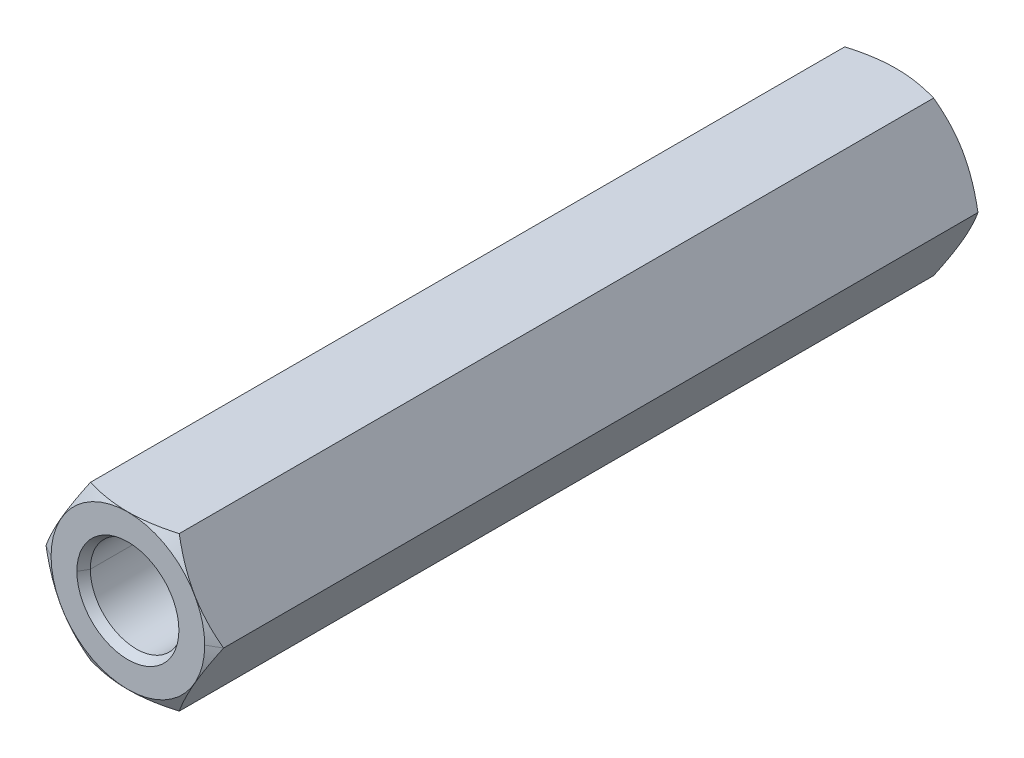
ISO-10303-21;
HEADER;
FILE_DESCRIPTION(('STEP AP214'),'2;1');
FILE_NAME('part.step','',(''),(''),'','','');
FILE_SCHEMA(('AUTOMOTIVE_DESIGN { 1 0 10303 214 1 1 1 1 }'));
ENDSEC;
DATA;
#1=APPLICATION_CONTEXT('core data for automotive mechanical design processes');
#2=APPLICATION_PROTOCOL_DEFINITION('international standard','automotive_design',2000,#1);
#3=PRODUCT_CONTEXT('',#1,'mechanical');
#4=PRODUCT('Part','Part','',(#3));
#5=PRODUCT_RELATED_PRODUCT_CATEGORY('part','',(#4));
#6=PRODUCT_DEFINITION_FORMATION('','',#4);
#7=PRODUCT_DEFINITION_CONTEXT('part definition',#1,'design');
#8=PRODUCT_DEFINITION('design','',#6,#7);
#9=PRODUCT_DEFINITION_SHAPE('','',#8);
#10=(LENGTH_UNIT() NAMED_UNIT(*) SI_UNIT(.MILLI.,.METRE.));
#11=(NAMED_UNIT(*) PLANE_ANGLE_UNIT() SI_UNIT($,.RADIAN.));
#12=(NAMED_UNIT(*) SI_UNIT($,.STERADIAN.) SOLID_ANGLE_UNIT());
#13=UNCERTAINTY_MEASURE_WITH_UNIT(LENGTH_MEASURE(1.E-05),#10,'distance_accuracy_value','');
#14=(GEOMETRIC_REPRESENTATION_CONTEXT(3) GLOBAL_UNCERTAINTY_ASSIGNED_CONTEXT((#13)) GLOBAL_UNIT_ASSIGNED_CONTEXT((#10,
#11,#12)) REPRESENTATION_CONTEXT('',''));
#15=CARTESIAN_POINT('',(0.,0.,0.));
#16=DIRECTION('',(0.,0.,1.));
#17=DIRECTION('',(1.,0.,0.));
#18=AXIS2_PLACEMENT_3D('',#15,#16,#17);
#19=CARTESIAN_POINT('',(116.318744279938,82.5620432923505,90.4476083123826));
#20=DIRECTION('',(0.,0.,-1.));
#21=DIRECTION('',(1.,0.,0.));
#22=AXIS2_PLACEMENT_3D('',#19,#20,#21);
#23=CONICAL_SURFACE('',#22,1.73205080757048,1.047197551197);
#24=DIRECTION('',(0.86602540378464,0.,-0.499999999999652));
#25=VECTOR('',#24,1.);
#26=CARTESIAN_POINT('',(118.050795087508,82.5620432923505,90.4476083123826));
#27=LINE('',#26,#25);
#28=CARTESIAN_POINT('',(116.318744279938,82.5620432923505,91.4476083123826));
#29=VERTEX_POINT('',#28);
#30=CARTESIAN_POINT('',(117.818744279938,82.5620432923505,90.5815829085986));
#31=VERTEX_POINT('',#30);
#32=EDGE_CURVE('E67',#29,#31,#27,.T.);
#33=ORIENTED_EDGE('',*,*,#32,.F.);
#34=DIRECTION('',(-0.86602540378464,0.,-0.499999999999652));
#35=VECTOR('',#34,1.);
#36=CARTESIAN_POINT('',(114.586693472367,82.5620432923505,90.4476083123826));
#37=LINE('',#36,#35);
#38=CARTESIAN_POINT('',(114.818744279938,82.5620432923505,90.5815829085986));
#39=VERTEX_POINT('',#38);
#40=EDGE_CURVE('E11',#29,#39,#37,.T.);
#41=ORIENTED_EDGE('',*,*,#40,.T.);
#42=CARTESIAN_POINT('',(116.318744279938,82.5620432923505,90.5815829085986));
#43=DIRECTION('',(0.,0.,1.));
#44=DIRECTION('',(1.,0.,0.));
#45=AXIS2_PLACEMENT_3D('',#42,#43,#44);
#46=CIRCLE('',#45,1.5);
#47=EDGE_CURVE('E55',#31,#39,#46,.T.);
#48=ORIENTED_EDGE('',*,*,#47,.F.);
#49=EDGE_LOOP('',(#33,#41,#48));
#50=FACE_BOUND('',#49,.T.);
#51=ADVANCED_FACE('F44',(#50),#23,.F.);
#52=CARTESIAN_POINT('',(116.318744279938,82.5620432923505,90.5815829085986));
#53=DIRECTION('',(0.,0.,-1.));
#54=DIRECTION('',(1.,0.,0.));
#55=AXIS2_PLACEMENT_3D('',#52,#53,#54);
#56=CYLINDRICAL_SURFACE('',#55,1.5);
#57=ORIENTED_EDGE('',*,*,#47,.T.);
#58=DIRECTION('',(0.,0.,-1.));
#59=VECTOR('',#58,1.);
#60=CARTESIAN_POINT('',(114.818744279938,82.5620432923505,90.5815829085986));
#61=LINE('',#60,#59);
#62=CARTESIAN_POINT('',(114.818744279938,82.5620432923505,80.8587110378087));
#63=VERTEX_POINT('',#62);
#64=EDGE_CURVE('E313',#39,#63,#61,.T.);
#65=ORIENTED_EDGE('',*,*,#64,.T.);
#66=CARTESIAN_POINT('',(116.318744279938,82.5620432923505,80.8587110378087));
#67=DIRECTION('',(0.,0.,1.));
#68=DIRECTION('',(1.,0.,0.));
#69=AXIS2_PLACEMENT_3D('',#66,#67,#68);
#70=CIRCLE('',#69,1.5);
#71=CARTESIAN_POINT('',(117.818744279938,82.5620432923505,80.8587110378087));
#72=VERTEX_POINT('',#71);
#73=EDGE_CURVE('E305',#72,#63,#70,.T.);
#74=ORIENTED_EDGE('',*,*,#73,.F.);
#75=DIRECTION('',(0.,0.,-1.));
#76=VECTOR('',#75,1.);
#77=CARTESIAN_POINT('',(117.818744279938,82.5620432923505,90.5815829085986));
#78=LINE('',#77,#76);
#79=EDGE_CURVE('E364',#31,#72,#78,.T.);
#80=ORIENTED_EDGE('',*,*,#79,.F.);
#81=EDGE_LOOP('',(#57,#65,#74,#80));
#82=FACE_BOUND('',#81,.T.);
#83=ADVANCED_FACE('F505',(#82),#56,.F.);
#84=CARTESIAN_POINT('',(116.318744279938,82.5620432923505,80.8587110378087));
#85=DIRECTION('',(0.,0.,-1.));
#86=DIRECTION('',(1.,0.,0.));
#87=AXIS2_PLACEMENT_3D('',#84,#85,#86);
#88=CONICAL_SURFACE('',#87,1.5,0.5235987756);
#89=ORIENTED_EDGE('',*,*,#73,.T.);
#90=DIRECTION('',(-0.500000000001473,0.,-0.866025403783588));
#91=VECTOR('',#90,1.);
#92=CARTESIAN_POINT('',(114.818744279938,82.5620432923505,80.8587110378087));
#93=LINE('',#92,#91);
#94=CARTESIAN_POINT('',(114.658744279938,82.5620432923505,80.5815829085986));
#95=VERTEX_POINT('',#94);
#96=EDGE_CURVE('E299',#63,#95,#93,.T.);
#97=ORIENTED_EDGE('',*,*,#96,.T.);
#98=CARTESIAN_POINT('',(116.318744279938,82.5620432923505,80.5815829085986));
#99=DIRECTION('',(0.,0.,1.));
#100=DIRECTION('',(1.,0.,0.));
#101=AXIS2_PLACEMENT_3D('',#98,#99,#100);
#102=CIRCLE('',#101,1.66);
#103=CARTESIAN_POINT('',(117.978744279938,82.5620432923505,80.5815829085986));
#104=VERTEX_POINT('',#103);
#105=EDGE_CURVE('E240',#104,#95,#102,.T.);
#106=ORIENTED_EDGE('',*,*,#105,.F.);
#107=DIRECTION('',(0.500000000001473,0.,-0.866025403783588));
#108=VECTOR('',#107,1.);
#109=CARTESIAN_POINT('',(117.818744279938,82.5620432923505,80.8587110378087));
#110=LINE('',#109,#108);
#111=EDGE_CURVE('E244',#72,#104,#110,.T.);
#112=ORIENTED_EDGE('',*,*,#111,.F.);
#113=EDGE_LOOP('',(#89,#97,#106,#112));
#114=FACE_BOUND('',#113,.T.);
#115=ADVANCED_FACE('F509',(#114),#88,.F.);
#116=CARTESIAN_POINT('',(116.318744279938,82.5620432923505,80.5815829085986));
#117=DIRECTION('',(0.,0.,1.));
#118=DIRECTION('',(1.,0.,0.));
#119=AXIS2_PLACEMENT_3D('',#116,#117,#118);
#120=CONICAL_SURFACE('',#119,2.5,1.047197551197);
#121=CARTESIAN_POINT('',(116.318744279938,82.5620432923505,80.5815829085986));
#122=DIRECTION('',(0.,0.,1.));
#123=DIRECTION('',(1.,0.,0.));
#124=AXIS2_PLACEMENT_3D('',#121,#122,#123);
#125=CIRCLE('',#124,2.5);
#126=CARTESIAN_POINT('',(118.818744279938,82.5620432923505,80.5815829085986));
#127=VERTEX_POINT('',#126);
#128=CARTESIAN_POINT('',(113.818744279938,82.5620432923505,80.5815829085986));
#129=VERTEX_POINT('',#128);
#130=EDGE_CURVE('E209',#127,#129,#125,.T.);
#131=ORIENTED_EDGE('',*,*,#130,.T.);
#132=DIRECTION('',(-0.86602540378464,0.,0.499999999999652));
#133=VECTOR('',#132,1.);
#134=CARTESIAN_POINT('',(113.818744279938,82.5620432923505,80.5815829085986));
#135=LINE('',#134,#133);
#136=CARTESIAN_POINT('',(113.428744279938,82.5620432923504,80.8067495135827));
#137=VERTEX_POINT('',#136);
#138=EDGE_CURVE('E206',#129,#137,#135,.T.);
#139=ORIENTED_EDGE('',*,*,#138,.T.);
#140=CARTESIAN_POINT('',(114.873744279938,85.0648567092875,80.8067495135827));
#141=CARTESIAN_POINT('',(114.151244279938,83.8134500008194,80.3896139440931));
#142=CARTESIAN_POINT('',(113.428744279938,82.5620432923504,80.8067495135827));
#143=(BOUNDED_CURVE() B_SPLINE_CURVE(2,(#140,#141,#142),.UNSPECIFIED.,.F.,
.F.) B_SPLINE_CURVE_WITH_KNOTS((3,3),(0.,1.),
.UNSPECIFIED.) CURVE() GEOMETRIC_REPRESENTATION_ITEM() RATIONAL_B_SPLINE_CURVE((1.,
1.15470053837935,1.)) REPRESENTATION_ITEM(''));
#144=CARTESIAN_POINT('',(114.873744279938,85.0648567092875,80.8067495135827));
#145=VERTEX_POINT('',#144);
#146=EDGE_CURVE('E181',#145,#137,#143,.T.);
#147=ORIENTED_EDGE('',*,*,#146,.F.);
#148=CARTESIAN_POINT('',(117.763744279938,85.0648567092875,80.8067495135827));
#149=CARTESIAN_POINT('',(116.318744279938,85.0648567092875,80.3896139440931));
#150=CARTESIAN_POINT('',(114.873744279938,85.0648567092875,80.8067495135827));
#151=(BOUNDED_CURVE() B_SPLINE_CURVE(2,(#148,#149,#150),.UNSPECIFIED.,.F.,
.F.) B_SPLINE_CURVE_WITH_KNOTS((3,3),(0.,1.),
.UNSPECIFIED.) CURVE() GEOMETRIC_REPRESENTATION_ITEM() RATIONAL_B_SPLINE_CURVE((1.,
1.15470053837926,1.)) REPRESENTATION_ITEM(''));
#152=CARTESIAN_POINT('',(117.763744279938,85.0648567092875,80.8067495135827));
#153=VERTEX_POINT('',#152);
#154=EDGE_CURVE('E252',#153,#145,#151,.T.);
#155=ORIENTED_EDGE('',*,*,#154,.F.);
#156=CARTESIAN_POINT('',(119.208744279938,82.5620432923505,80.8067495135827));
#157=CARTESIAN_POINT('',(118.486244279938,83.8134500008189,80.389613944093));
#158=CARTESIAN_POINT('',(117.763744279938,85.0648567092875,80.8067495135827));
#159=(BOUNDED_CURVE() B_SPLINE_CURVE(2,(#156,#157,#158),.UNSPECIFIED.,.F.,
.F.) B_SPLINE_CURVE_WITH_KNOTS((3,3),(0.,1.),
.UNSPECIFIED.) CURVE() GEOMETRIC_REPRESENTATION_ITEM() RATIONAL_B_SPLINE_CURVE((1.,
1.15470053837946,1.)) REPRESENTATION_ITEM(''));
#160=CARTESIAN_POINT('',(119.208744279938,82.5620432923505,80.8067495135827));
#161=VERTEX_POINT('',#160);
#162=EDGE_CURVE('E356',#161,#153,#159,.T.);
#163=ORIENTED_EDGE('',*,*,#162,.F.);
#164=DIRECTION('',(0.86602540378464,0.,0.499999999999652));
#165=VECTOR('',#164,1.);
#166=CARTESIAN_POINT('',(118.818744279938,82.5620432923505,80.5815829085986));
#167=LINE('',#166,#165);
#168=EDGE_CURVE('E323',#127,#161,#167,.T.);
#169=ORIENTED_EDGE('',*,*,#168,.F.);
#170=EDGE_LOOP('',(#131,#139,#147,#155,#163,#169));
#171=FACE_BOUND('',#170,.T.);
#172=ADVANCED_FACE('F207',(#171),#120,.T.);
#173=CARTESIAN_POINT('',(116.318744279938,82.5620432923505,105.356416303615));
#174=DIRECTION('',(0.,0.,-1.));
#175=DIRECTION('',(1.,0.,0.));
#176=AXIS2_PLACEMENT_3D('',#173,#174,#175);
#177=CONICAL_SURFACE('',#176,2.89,1.047197551197);
#178=CARTESIAN_POINT('',(116.318744279938,82.5620432923505,105.581582908599));
#179=DIRECTION('',(0.,0.,1.));
#180=DIRECTION('',(1.,0.,0.));
#181=AXIS2_PLACEMENT_3D('',#178,#179,#180);
#182=CIRCLE('',#181,2.5);
#183=CARTESIAN_POINT('',(113.818744279938,82.5620432923505,105.581582908599));
#184=VERTEX_POINT('',#183);
#185=CARTESIAN_POINT('',(118.818744279938,82.5620432923505,105.581582908599));
#186=VERTEX_POINT('',#185);
#187=EDGE_CURVE('E330',#184,#186,#182,.T.);
#188=ORIENTED_EDGE('',*,*,#187,.F.);
#189=DIRECTION('',(-0.86602540378464,0.,-0.499999999999652));
#190=VECTOR('',#189,1.);
#191=CARTESIAN_POINT('',(113.428744279938,82.5620432923505,105.356416303615));
#192=LINE('',#191,#190);
#193=CARTESIAN_POINT('',(113.428744279938,82.5620432923506,105.356416303615));
#194=VERTEX_POINT('',#193);
#195=EDGE_CURVE('E214',#184,#194,#192,.T.);
#196=ORIENTED_EDGE('',*,*,#195,.T.);
#197=CARTESIAN_POINT('',(114.873744279938,80.0592298754135,105.356416303615));
#198=CARTESIAN_POINT('',(114.151244279938,81.3106365838816,105.773551873104));
#199=CARTESIAN_POINT('',(113.428744279938,82.5620432923506,105.356416303615));
#200=(BOUNDED_CURVE() B_SPLINE_CURVE(2,(#197,#198,#199),.UNSPECIFIED.,.F.,
.F.) B_SPLINE_CURVE_WITH_KNOTS((3,3),(0.,1.),
.UNSPECIFIED.) CURVE() GEOMETRIC_REPRESENTATION_ITEM() RATIONAL_B_SPLINE_CURVE((1.,
1.15470053837936,1.)) REPRESENTATION_ITEM(''));
#201=CARTESIAN_POINT('',(114.873744279938,80.0592298754135,105.356416303615));
#202=VERTEX_POINT('',#201);
#203=EDGE_CURVE('E201',#202,#194,#200,.T.);
#204=ORIENTED_EDGE('',*,*,#203,.F.);
#205=CARTESIAN_POINT('',(117.763744279938,80.0592298754135,105.356416303615));
#206=CARTESIAN_POINT('',(116.318744279938,80.0592298754135,105.773551873104));
#207=CARTESIAN_POINT('',(114.873744279938,80.0592298754135,105.356416303615));
#208=(BOUNDED_CURVE() B_SPLINE_CURVE(2,(#205,#206,#207),.UNSPECIFIED.,.F.,
.F.) B_SPLINE_CURVE_WITH_KNOTS((3,3),(0.,1.),
.UNSPECIFIED.) CURVE() GEOMETRIC_REPRESENTATION_ITEM() RATIONAL_B_SPLINE_CURVE((1.,
1.15470053837925,1.)) REPRESENTATION_ITEM(''));
#209=CARTESIAN_POINT('',(117.763744279938,80.0592298754135,105.356416303615));
#210=VERTEX_POINT('',#209);
#211=EDGE_CURVE('E274',#210,#202,#208,.T.);
#212=ORIENTED_EDGE('',*,*,#211,.F.);
#213=CARTESIAN_POINT('',(119.208744279938,82.5620432923505,105.356416303615));
#214=CARTESIAN_POINT('',(118.486244279938,81.3106365838821,105.773551873104));
#215=CARTESIAN_POINT('',(117.763744279938,80.0592298754135,105.356416303615));
#216=(BOUNDED_CURVE() B_SPLINE_CURVE(2,(#213,#214,#215),.UNSPECIFIED.,.F.,
.F.) B_SPLINE_CURVE_WITH_KNOTS((3,3),(0.,1.),
.UNSPECIFIED.) CURVE() GEOMETRIC_REPRESENTATION_ITEM() RATIONAL_B_SPLINE_CURVE((1.,
1.15470053837944,1.)) REPRESENTATION_ITEM(''));
#217=CARTESIAN_POINT('',(119.208744279938,82.5620432923505,105.356416303615));
#218=VERTEX_POINT('',#217);
#219=EDGE_CURVE('E262',#218,#210,#216,.T.);
#220=ORIENTED_EDGE('',*,*,#219,.F.);
#221=DIRECTION('',(0.86602540378464,0.,-0.499999999999652));
#222=VECTOR('',#221,1.);
#223=CARTESIAN_POINT('',(119.208744279938,82.5620432923505,105.356416303615));
#224=LINE('',#223,#222);
#225=EDGE_CURVE('E326',#186,#218,#224,.T.);
#226=ORIENTED_EDGE('',*,*,#225,.F.);
#227=EDGE_LOOP('',(#188,#196,#204,#212,#220,#226));
#228=FACE_BOUND('',#227,.T.);
#229=ADVANCED_FACE('F453',(#228),#177,.T.);
#230=CARTESIAN_POINT('',(116.318744279938,82.5620432923505,105.581582908599));
#231=DIRECTION('',(0.,0.,1.));
#232=DIRECTION('',(1.,0.,0.));
#233=AXIS2_PLACEMENT_3D('',#230,#231,#232);
#234=CONICAL_SURFACE('',#233,1.65999999999899,0.523598775598);
#235=CARTESIAN_POINT('',(116.318744279938,82.5620432923505,105.304454779389));
#236=DIRECTION('',(0.,0.,1.));
#237=DIRECTION('',(1.,0.,0.));
#238=AXIS2_PLACEMENT_3D('',#235,#236,#237);
#239=CIRCLE('',#238,1.5);
#240=CARTESIAN_POINT('',(114.818744279938,82.5620432923505,105.304454779389));
#241=VERTEX_POINT('',#240);
#242=CARTESIAN_POINT('',(117.818744279938,82.5620432923505,105.304454779389));
#243=VERTEX_POINT('',#242);
#244=EDGE_CURVE('E398',#241,#243,#239,.T.);
#245=ORIENTED_EDGE('',*,*,#244,.F.);
#246=DIRECTION('',(-0.499999999999741,0.,0.866025403784588));
#247=VECTOR('',#246,1.);
#248=CARTESIAN_POINT('',(114.658744279939,82.5620432923505,105.581582908599));
#249=LINE('',#248,#247);
#250=CARTESIAN_POINT('',(114.658744279939,82.5620432923505,105.581582908599));
#251=VERTEX_POINT('',#250);
#252=EDGE_CURVE('E269',#241,#251,#249,.T.);
#253=ORIENTED_EDGE('',*,*,#252,.T.);
#254=CARTESIAN_POINT('',(116.318744279938,82.5620432923505,105.581582908599));
#255=DIRECTION('',(0.,0.,1.));
#256=DIRECTION('',(1.,0.,0.));
#257=AXIS2_PLACEMENT_3D('',#254,#255,#256);
#258=CIRCLE('',#257,1.65999999999899);
#259=CARTESIAN_POINT('',(117.978744279937,82.5620432923505,105.581582908599));
#260=VERTEX_POINT('',#259);
#261=EDGE_CURVE('E341',#251,#260,#258,.T.);
#262=ORIENTED_EDGE('',*,*,#261,.T.);
#263=DIRECTION('',(0.499999999999741,0.,0.866025403784588));
#264=VECTOR('',#263,1.);
#265=CARTESIAN_POINT('',(117.978744279937,82.5620432923505,105.581582908599));
#266=LINE('',#265,#264);
#267=EDGE_CURVE('E48',#243,#260,#266,.T.);
#268=ORIENTED_EDGE('',*,*,#267,.F.);
#269=EDGE_LOOP('',(#245,#253,#262,#268));
#270=FACE_BOUND('',#269,.T.);
#271=ADVANCED_FACE('F484',(#270),#234,.F.);
#272=CARTESIAN_POINT('',(116.318744279938,82.5620432923505,105.304454779389));
#273=DIRECTION('',(0.,0.,-1.));
#274=DIRECTION('',(1.,0.,0.));
#275=AXIS2_PLACEMENT_3D('',#272,#273,#274);
#276=CYLINDRICAL_SURFACE('',#275,1.5);
#277=CARTESIAN_POINT('',(116.318744279938,82.5620432923505,105.304454779389));
#278=DIRECTION('',(0.,0.,1.));
#279=DIRECTION('',(1.,0.,0.));
#280=AXIS2_PLACEMENT_3D('',#277,#278,#279);
#281=CIRCLE('',#280,1.5);
#282=EDGE_CURVE('E338',#243,#241,#281,.T.);
#283=ORIENTED_EDGE('',*,*,#282,.T.);
#284=DIRECTION('',(0.,0.,-1.));
#285=VECTOR('',#284,1.);
#286=CARTESIAN_POINT('',(114.818744279938,82.5620432923505,105.304454779389));
#287=LINE('',#286,#285);
#288=CARTESIAN_POINT('',(114.818744279938,82.5620432923505,95.5815829085986));
#289=VERTEX_POINT('',#288);
#290=EDGE_CURVE('E287',#241,#289,#287,.T.);
#291=ORIENTED_EDGE('',*,*,#290,.T.);
#292=CARTESIAN_POINT('',(116.318744279938,82.5620432923505,95.5815829085986));
#293=DIRECTION('',(0.,0.,1.));
#294=DIRECTION('',(1.,0.,0.));
#295=AXIS2_PLACEMENT_3D('',#292,#293,#294);
#296=CIRCLE('',#295,1.5);
#297=CARTESIAN_POINT('',(117.818744279938,82.5620432923505,95.5815829085986));
#298=VERTEX_POINT('',#297);
#299=EDGE_CURVE('E402',#298,#289,#296,.T.);
#300=ORIENTED_EDGE('',*,*,#299,.F.);
#301=DIRECTION('',(0.,0.,-1.));
#302=VECTOR('',#301,1.);
#303=CARTESIAN_POINT('',(117.818744279938,82.5620432923505,105.304454779389));
#304=LINE('',#303,#302);
#305=EDGE_CURVE('E403',#243,#298,#304,.T.);
#306=ORIENTED_EDGE('',*,*,#305,.F.);
#307=EDGE_LOOP('',(#283,#291,#300,#306));
#308=FACE_BOUND('',#307,.T.);
#309=ADVANCED_FACE('F488',(#308),#276,.F.);
#310=CARTESIAN_POINT('',(116.318744279938,82.5620432923505,95.5815829085986));
#311=DIRECTION('',(0.,0.,1.));
#312=DIRECTION('',(1.,0.,0.));
#313=AXIS2_PLACEMENT_3D('',#310,#311,#312);
#314=CONICAL_SURFACE('',#313,1.5,1.047197551197);
#315=DIRECTION('',(0.86602540378464,0.,0.499999999999652));
#316=VECTOR('',#315,1.);
#317=CARTESIAN_POINT('',(117.818744279938,82.5620432923505,95.5815829085986));
#318=LINE('',#317,#316);
#319=CARTESIAN_POINT('',(116.318744279938,82.5620432923505,94.7155575048136));
#320=VERTEX_POINT('',#319);
#321=EDGE_CURVE('E413',#320,#298,#318,.T.);
#322=ORIENTED_EDGE('',*,*,#321,.F.);
#323=DIRECTION('',(-0.86602540378464,0.,0.499999999999652));
#324=VECTOR('',#323,1.);
#325=CARTESIAN_POINT('',(114.818744279938,82.5620432923505,95.5815829085986));
#326=LINE('',#325,#324);
#327=EDGE_CURVE('E283',#320,#289,#326,.T.);
#328=ORIENTED_EDGE('',*,*,#327,.T.);
#329=CARTESIAN_POINT('',(116.318744279938,82.5620432923505,95.5815829085986));
#330=DIRECTION('',(0.,0.,1.));
#331=DIRECTION('',(1.,0.,0.));
#332=AXIS2_PLACEMENT_3D('',#329,#330,#331);
#333=CIRCLE('',#332,1.5);
#334=EDGE_CURVE('E288',#289,#298,#333,.T.);
#335=ORIENTED_EDGE('',*,*,#334,.T.);
#336=EDGE_LOOP('',(#322,#328,#335));
#337=FACE_BOUND('',#336,.T.);
#338=ADVANCED_FACE('F493',(#337),#314,.F.);
#339=CARTESIAN_POINT('',(116.318744279938,82.5620432923505,95.5815829085986));
#340=DIRECTION('',(0.,0.,1.));
#341=DIRECTION('',(1.,0.,0.));
#342=AXIS2_PLACEMENT_3D('',#339,#340,#341);
#343=CONICAL_SURFACE('',#342,1.5,1.047197551197);
#344=ORIENTED_EDGE('',*,*,#327,.F.);
#345=ORIENTED_EDGE('',*,*,#321,.T.);
#346=ORIENTED_EDGE('',*,*,#299,.T.);
#347=EDGE_LOOP('',(#344,#345,#346));
#348=FACE_BOUND('',#347,.T.);
#349=ADVANCED_FACE('F491',(#348),#343,.F.);
#350=CARTESIAN_POINT('',(116.318744279938,82.5620432923505,105.304454779389));
#351=DIRECTION('',(0.,0.,-1.));
#352=DIRECTION('',(1.,0.,0.));
#353=AXIS2_PLACEMENT_3D('',#350,#351,#352);
#354=CYLINDRICAL_SURFACE('',#353,1.5);
#355=ORIENTED_EDGE('',*,*,#290,.F.);
#356=ORIENTED_EDGE('',*,*,#244,.T.);
#357=ORIENTED_EDGE('',*,*,#305,.T.);
#358=ORIENTED_EDGE('',*,*,#334,.F.);
#359=EDGE_LOOP('',(#355,#356,#357,#358));
#360=FACE_BOUND('',#359,.T.);
#361=ADVANCED_FACE('F486',(#360),#354,.F.);
#362=CARTESIAN_POINT('',(116.318744279938,82.5620432923505,105.581582908599));
#363=DIRECTION('',(0.,0.,1.));
#364=DIRECTION('',(1.,0.,0.));
#365=AXIS2_PLACEMENT_3D('',#362,#363,#364);
#366=CONICAL_SURFACE('',#365,1.65999999999899,0.523598775598);
#367=ORIENTED_EDGE('',*,*,#252,.F.);
#368=ORIENTED_EDGE('',*,*,#282,.F.);
#369=ORIENTED_EDGE('',*,*,#267,.T.);
#370=CARTESIAN_POINT('',(116.318744279938,82.5620432923505,105.581582908599));
#371=DIRECTION('',(0.,0.,1.));
#372=DIRECTION('',(1.,0.,0.));
#373=AXIS2_PLACEMENT_3D('',#370,#371,#372);
#374=CIRCLE('',#373,1.65999999999899);
#375=EDGE_CURVE('E331',#260,#251,#374,.T.);
#376=ORIENTED_EDGE('',*,*,#375,.T.);
#377=EDGE_LOOP('',(#367,#368,#369,#376));
#378=FACE_BOUND('',#377,.T.);
#379=ADVANCED_FACE('F483',(#378),#366,.F.);
#380=CARTESIAN_POINT('',(116.318744279938,82.5620432923505,105.581582908599));
#381=DIRECTION('',(0.,0.,1.));
#382=DIRECTION('',(1.,0.,0.));
#383=AXIS2_PLACEMENT_3D('',#380,#381,#382);
#384=PLANE('',#383);
#385=CARTESIAN_POINT('',(116.318744279938,82.5620432923505,105.581582908599));
#386=DIRECTION('',(0.,0.,1.));
#387=DIRECTION('',(1.,0.,0.));
#388=AXIS2_PLACEMENT_3D('',#385,#386,#387);
#389=CIRCLE('',#388,2.5);
#390=EDGE_CURVE('E335',#186,#184,#389,.T.);
#391=ORIENTED_EDGE('',*,*,#390,.T.);
#392=ORIENTED_EDGE('',*,*,#187,.T.);
#393=EDGE_LOOP('',(#391,#392));
#394=FACE_BOUND('',#393,.T.);
#395=ORIENTED_EDGE('',*,*,#375,.F.);
#396=ORIENTED_EDGE('',*,*,#261,.F.);
#397=EDGE_LOOP('',(#395,#396));
#398=FACE_BOUND('',#397,.T.);
#399=ADVANCED_FACE('F459',(#394,#398),#384,.T.);
#400=CARTESIAN_POINT('',(116.318744279938,82.5620432923505,105.356416303615));
#401=DIRECTION('',(0.,0.,-1.));
#402=DIRECTION('',(1.,0.,0.));
#403=AXIS2_PLACEMENT_3D('',#400,#401,#402);
#404=CONICAL_SURFACE('',#403,2.89,1.047197551197);
#405=ORIENTED_EDGE('',*,*,#195,.F.);
#406=ORIENTED_EDGE('',*,*,#390,.F.);
#407=ORIENTED_EDGE('',*,*,#225,.T.);
#408=CARTESIAN_POINT('',(117.763744279938,85.0648567092875,105.356416303615));
#409=CARTESIAN_POINT('',(118.486244279938,83.8134500008194,105.773551873104));
#410=CARTESIAN_POINT('',(119.208744279938,82.5620432923505,105.356416303615));
#411=(BOUNDED_CURVE() B_SPLINE_CURVE(2,(#408,#409,#410),.UNSPECIFIED.,.F.,
.F.) B_SPLINE_CURVE_WITH_KNOTS((3,3),(0.,1.),
.UNSPECIFIED.) CURVE() GEOMETRIC_REPRESENTATION_ITEM() RATIONAL_B_SPLINE_CURVE((1.,
1.15470053837935,1.)) REPRESENTATION_ITEM(''));
#412=CARTESIAN_POINT('',(117.763744279938,85.0648567092875,105.356416303615));
#413=VERTEX_POINT('',#412);
#414=EDGE_CURVE('E282',#413,#218,#411,.T.);
#415=ORIENTED_EDGE('',*,*,#414,.F.);
#416=CARTESIAN_POINT('',(114.873744279938,85.0648567092875,105.356416303615));
#417=CARTESIAN_POINT('',(116.318744279938,85.0648567092875,105.773551873104));
#418=CARTESIAN_POINT('',(117.763744279938,85.0648567092875,105.356416303615));
#419=(BOUNDED_CURVE() B_SPLINE_CURVE(2,(#416,#417,#418),.UNSPECIFIED.,.F.,
.F.) B_SPLINE_CURVE_WITH_KNOTS((3,3),(0.,1.),
.UNSPECIFIED.) CURVE() GEOMETRIC_REPRESENTATION_ITEM() RATIONAL_B_SPLINE_CURVE((1.,
1.15470053837925,1.)) REPRESENTATION_ITEM(''));
#420=CARTESIAN_POINT('',(114.873744279938,85.0648567092875,105.356416303615));
#421=VERTEX_POINT('',#420);
#422=EDGE_CURVE('E246',#421,#413,#419,.T.);
#423=ORIENTED_EDGE('',*,*,#422,.F.);
#424=CARTESIAN_POINT('',(113.428744279938,82.5620432923506,105.356416303615));
#425=CARTESIAN_POINT('',(114.151244279937,83.8134500008188,105.773551873104));
#426=CARTESIAN_POINT('',(114.873744279938,85.0648567092875,105.356416303615));
#427=(BOUNDED_CURVE() B_SPLINE_CURVE(2,(#424,#425,#426),.UNSPECIFIED.,.F.,
.F.) B_SPLINE_CURVE_WITH_KNOTS((3,3),(0.,1.),
.UNSPECIFIED.) CURVE() GEOMETRIC_REPRESENTATION_ITEM() RATIONAL_B_SPLINE_CURVE((1.,
1.15470053837944,1.)) REPRESENTATION_ITEM(''));
#428=EDGE_CURVE('E192',#194,#421,#427,.T.);
#429=ORIENTED_EDGE('',*,*,#428,.F.);
#430=EDGE_LOOP('',(#405,#406,#407,#415,#423,#429));
#431=FACE_BOUND('',#430,.T.);
#432=ADVANCED_FACE('F457',(#431),#404,.T.);
#433=CARTESIAN_POINT('',(117.763744279938,80.0592298754135,80.5815829085986));
#434=DIRECTION('',(-0.866025403784329,0.50000000000019,0.));
#435=DIRECTION('',(0.,0.,1.));
#436=AXIS2_PLACEMENT_3D('',#433,#434,#435);
#437=PLANE('',#436);
#438=DIRECTION('',(0.,0.,1.));
#439=VECTOR('',#438,1.);
#440=CARTESIAN_POINT('',(119.208744279938,82.5620432923505,80.8067495135827));
#441=LINE('',#440,#439);
#442=EDGE_CURVE('E293',#161,#218,#441,.T.);
#443=ORIENTED_EDGE('',*,*,#442,.T.);
#444=ORIENTED_EDGE('',*,*,#219,.T.);
#445=DIRECTION('',(0.,0.,1.));
#446=VECTOR('',#445,1.);
#447=CARTESIAN_POINT('',(117.763744279938,80.0592298754135,80.5815829085986));
#448=LINE('',#447,#446);
#449=CARTESIAN_POINT('',(117.763744279938,80.0592298754135,80.8067495135827));
#450=VERTEX_POINT('',#449);
#451=EDGE_CURVE('E263',#450,#210,#448,.T.);
#452=ORIENTED_EDGE('',*,*,#451,.F.);
#453=CARTESIAN_POINT('',(117.763744279938,80.0592298754135,80.8067495135827));
#454=CARTESIAN_POINT('',(118.486244279938,81.3106365838816,80.389613944093));
#455=CARTESIAN_POINT('',(119.208744279938,82.5620432923505,80.8067495135827));
#456=(BOUNDED_CURVE() B_SPLINE_CURVE(2,(#453,#454,#455),.UNSPECIFIED.,.F.,
.F.) B_SPLINE_CURVE_WITH_KNOTS((3,3),(0.,1.),
.UNSPECIFIED.) CURVE() GEOMETRIC_REPRESENTATION_ITEM() RATIONAL_B_SPLINE_CURVE((1.,
1.15470053837935,1.)) REPRESENTATION_ITEM(''));
#457=EDGE_CURVE('E253',#450,#161,#456,.T.);
#458=ORIENTED_EDGE('',*,*,#457,.T.);
#459=EDGE_LOOP('',(#443,#444,#452,#458));
#460=FACE_BOUND('',#459,.T.);
#461=ADVANCED_FACE('F443',(#460),#437,.F.);
#462=CARTESIAN_POINT('',(114.873744279938,80.0592298754135,80.5815829085986));
#463=DIRECTION('',(0.,1.,0.));
#464=DIRECTION('',(1.,0.,0.));
#465=AXIS2_PLACEMENT_3D('',#462,#463,#464);
#466=PLANE('',#465);
#467=ORIENTED_EDGE('',*,*,#451,.T.);
#468=ORIENTED_EDGE('',*,*,#211,.T.);
#469=DIRECTION('',(0.,0.,1.));
#470=VECTOR('',#469,1.);
#471=CARTESIAN_POINT('',(114.873744279938,80.0592298754135,80.5815829085986));
#472=LINE('',#471,#470);
#473=CARTESIAN_POINT('',(114.873744279938,80.0592298754135,80.8067495135827));
#474=VERTEX_POINT('',#473);
#475=EDGE_CURVE('E227',#474,#202,#472,.T.);
#476=ORIENTED_EDGE('',*,*,#475,.F.);
#477=CARTESIAN_POINT('',(114.873744279938,80.0592298754135,80.8067495135827));
#478=CARTESIAN_POINT('',(116.318744279938,80.0592298754135,80.3896139440931));
#479=CARTESIAN_POINT('',(117.763744279938,80.0592298754135,80.8067495135827));
#480=(BOUNDED_CURVE() B_SPLINE_CURVE(2,(#477,#478,#479),.UNSPECIFIED.,.F.,
.F.) B_SPLINE_CURVE_WITH_KNOTS((3,3),(0.,1.),
.UNSPECIFIED.) CURVE() GEOMETRIC_REPRESENTATION_ITEM() RATIONAL_B_SPLINE_CURVE((1.,
1.15470053837926,1.)) REPRESENTATION_ITEM(''));
#481=EDGE_CURVE('E220',#474,#450,#480,.T.);
#482=ORIENTED_EDGE('',*,*,#481,.T.);
#483=EDGE_LOOP('',(#467,#468,#476,#482));
#484=FACE_BOUND('',#483,.T.);
#485=ADVANCED_FACE('F462',(#484),#466,.F.);
#486=CARTESIAN_POINT('',(113.428744279938,82.5620432923505,80.5815829085986));
#487=DIRECTION('',(0.866025403784329,0.50000000000019,0.));
#488=DIRECTION('',(0.,0.,-1.));
#489=AXIS2_PLACEMENT_3D('',#486,#487,#488);
#490=PLANE('',#489);
#491=ORIENTED_EDGE('',*,*,#475,.T.);
#492=ORIENTED_EDGE('',*,*,#203,.T.);
#493=DIRECTION('',(0.,0.,1.));
#494=VECTOR('',#493,1.);
#495=CARTESIAN_POINT('',(113.428744279938,82.5620432923505,80.5815829085986));
#496=LINE('',#495,#494);
#497=EDGE_CURVE('E185',#137,#194,#496,.T.);
#498=ORIENTED_EDGE('',*,*,#497,.F.);
#499=CARTESIAN_POINT('',(113.428744279938,82.5620432923504,80.8067495135827));
#500=CARTESIAN_POINT('',(114.151244279937,81.3106365838821,80.3896139440929));
#501=CARTESIAN_POINT('',(114.873744279938,80.0592298754135,80.8067495135827));
#502=(BOUNDED_CURVE() B_SPLINE_CURVE(2,(#499,#500,#501),.UNSPECIFIED.,.F.,
.F.) B_SPLINE_CURVE_WITH_KNOTS((3,3),(0.,1.),
.UNSPECIFIED.) CURVE() GEOMETRIC_REPRESENTATION_ITEM() RATIONAL_B_SPLINE_CURVE((1.,
1.15470053837945,1.)) REPRESENTATION_ITEM(''));
#503=EDGE_CURVE('E200',#137,#474,#502,.T.);
#504=ORIENTED_EDGE('',*,*,#503,.T.);
#505=EDGE_LOOP('',(#491,#492,#498,#504));
#506=FACE_BOUND('',#505,.T.);
#507=ADVANCED_FACE('F198',(#506),#490,.F.);
#508=CARTESIAN_POINT('',(114.873744279938,85.0648567092875,80.5815829085986));
#509=DIRECTION('',(0.866025403784329,-0.50000000000019,0.));
#510=DIRECTION('',(0.,0.,-1.));
#511=AXIS2_PLACEMENT_3D('',#508,#509,#510);
#512=PLANE('',#511);
#513=ORIENTED_EDGE('',*,*,#497,.T.);
#514=ORIENTED_EDGE('',*,*,#428,.T.);
#515=DIRECTION('',(0.,0.,1.));
#516=VECTOR('',#515,1.);
#517=CARTESIAN_POINT('',(114.873744279938,85.0648567092875,80.5815829085986));
#518=LINE('',#517,#516);
#519=EDGE_CURVE('E187',#145,#421,#518,.T.);
#520=ORIENTED_EDGE('',*,*,#519,.F.);
#521=ORIENTED_EDGE('',*,*,#146,.T.);
#522=EDGE_LOOP('',(#513,#514,#520,#521));
#523=FACE_BOUND('',#522,.T.);
#524=ADVANCED_FACE('F183',(#523),#512,.F.);
#525=CARTESIAN_POINT('',(117.763744279938,85.0648567092875,80.5815829085986));
#526=DIRECTION('',(0.,-1.,0.));
#527=DIRECTION('',(-1.,0.,0.));
#528=AXIS2_PLACEMENT_3D('',#525,#526,#527);
#529=PLANE('',#528);
#530=ORIENTED_EDGE('',*,*,#519,.T.);
#531=ORIENTED_EDGE('',*,*,#422,.T.);
#532=DIRECTION('',(0.,0.,1.));
#533=VECTOR('',#532,1.);
#534=CARTESIAN_POINT('',(117.763744279938,85.0648567092875,80.5815829085986));
#535=LINE('',#534,#533);
#536=EDGE_CURVE('E275',#153,#413,#535,.T.);
#537=ORIENTED_EDGE('',*,*,#536,.F.);
#538=ORIENTED_EDGE('',*,*,#154,.T.);
#539=EDGE_LOOP('',(#530,#531,#537,#538));
#540=FACE_BOUND('',#539,.T.);
#541=ADVANCED_FACE('F550',(#540),#529,.F.);
#542=CARTESIAN_POINT('',(119.208744279938,82.5620432923505,80.5815829085986));
#543=DIRECTION('',(-0.866025403784329,-0.50000000000019,0.));
#544=DIRECTION('',(-0.50000000000019,0.866025403784329,0.));
#545=AXIS2_PLACEMENT_3D('',#542,#543,#544);
#546=PLANE('',#545);
#547=ORIENTED_EDGE('',*,*,#536,.T.);
#548=ORIENTED_EDGE('',*,*,#414,.T.);
#549=ORIENTED_EDGE('',*,*,#442,.F.);
#550=ORIENTED_EDGE('',*,*,#162,.T.);
#551=EDGE_LOOP('',(#547,#548,#549,#550));
#552=FACE_BOUND('',#551,.T.);
#553=ADVANCED_FACE('F448',(#552),#546,.F.);
#554=CARTESIAN_POINT('',(116.318744279938,82.5620432923505,80.5815829085986));
#555=DIRECTION('',(0.,0.,1.));
#556=DIRECTION('',(1.,0.,0.));
#557=AXIS2_PLACEMENT_3D('',#554,#555,#556);
#558=CONICAL_SURFACE('',#557,2.5,1.047197551197);
#559=ORIENTED_EDGE('',*,*,#138,.F.);
#560=CARTESIAN_POINT('',(116.318744279938,82.5620432923505,80.5815829085986));
#561=DIRECTION('',(0.,0.,1.));
#562=DIRECTION('',(1.,0.,0.));
#563=AXIS2_PLACEMENT_3D('',#560,#561,#562);
#564=CIRCLE('',#563,2.5);
#565=EDGE_CURVE('E325',#129,#127,#564,.T.);
#566=ORIENTED_EDGE('',*,*,#565,.T.);
#567=ORIENTED_EDGE('',*,*,#168,.T.);
#568=ORIENTED_EDGE('',*,*,#457,.F.);
#569=ORIENTED_EDGE('',*,*,#481,.F.);
#570=ORIENTED_EDGE('',*,*,#503,.F.);
#571=EDGE_LOOP('',(#559,#566,#567,#568,#569,#570));
#572=FACE_BOUND('',#571,.T.);
#573=ADVANCED_FACE('F217',(#572),#558,.T.);
#574=CARTESIAN_POINT('',(116.318744279938,82.5620432923505,80.5815829085986));
#575=DIRECTION('',(0.,0.,1.));
#576=DIRECTION('',(1.,0.,0.));
#577=AXIS2_PLACEMENT_3D('',#574,#575,#576);
#578=PLANE('',#577);
#579=ORIENTED_EDGE('',*,*,#130,.F.);
#580=ORIENTED_EDGE('',*,*,#565,.F.);
#581=EDGE_LOOP('',(#579,#580));
#582=FACE_BOUND('',#581,.T.);
#583=ORIENTED_EDGE('',*,*,#105,.T.);
#584=CARTESIAN_POINT('',(116.318744279938,82.5620432923505,80.5815829085986));
#585=DIRECTION('',(0.,0.,1.));
#586=DIRECTION('',(1.,0.,0.));
#587=AXIS2_PLACEMENT_3D('',#584,#585,#586);
#588=CIRCLE('',#587,1.66);
#589=EDGE_CURVE('E234',#95,#104,#588,.T.);
#590=ORIENTED_EDGE('',*,*,#589,.T.);
#591=EDGE_LOOP('',(#583,#590));
#592=FACE_BOUND('',#591,.T.);
#593=ADVANCED_FACE('F524',(#582,#592),#578,.F.);
#594=CARTESIAN_POINT('',(116.318744279938,82.5620432923505,80.8587110378087));
#595=DIRECTION('',(0.,0.,-1.));
#596=DIRECTION('',(1.,0.,0.));
#597=AXIS2_PLACEMENT_3D('',#594,#595,#596);
#598=CONICAL_SURFACE('',#597,1.5,0.5235987756);
#599=ORIENTED_EDGE('',*,*,#96,.F.);
#600=CARTESIAN_POINT('',(116.318744279938,82.5620432923505,80.8587110378087));
#601=DIRECTION('',(0.,0.,1.));
#602=DIRECTION('',(1.,0.,0.));
#603=AXIS2_PLACEMENT_3D('',#600,#601,#602);
#604=CIRCLE('',#603,1.5);
#605=EDGE_CURVE('E241',#63,#72,#604,.T.);
#606=ORIENTED_EDGE('',*,*,#605,.T.);
#607=ORIENTED_EDGE('',*,*,#111,.T.);
#608=ORIENTED_EDGE('',*,*,#589,.F.);
#609=EDGE_LOOP('',(#599,#606,#607,#608));
#610=FACE_BOUND('',#609,.T.);
#611=ADVANCED_FACE('F526',(#610),#598,.F.);
#612=CARTESIAN_POINT('',(116.318744279938,82.5620432923505,90.5815829085986));
#613=DIRECTION('',(0.,0.,-1.));
#614=DIRECTION('',(1.,0.,0.));
#615=AXIS2_PLACEMENT_3D('',#612,#613,#614);
#616=CYLINDRICAL_SURFACE('',#615,1.5);
#617=ORIENTED_EDGE('',*,*,#64,.F.);
#618=CARTESIAN_POINT('',(116.318744279938,82.5620432923505,90.5815829085986));
#619=DIRECTION('',(0.,0.,1.));
#620=DIRECTION('',(1.,0.,0.));
#621=AXIS2_PLACEMENT_3D('',#618,#619,#620);
#622=CIRCLE('',#621,1.5);
#623=EDGE_CURVE('E366',#39,#31,#622,.T.);
#624=ORIENTED_EDGE('',*,*,#623,.T.);
#625=ORIENTED_EDGE('',*,*,#79,.T.);
#626=ORIENTED_EDGE('',*,*,#605,.F.);
#627=EDGE_LOOP('',(#617,#624,#625,#626));
#628=FACE_BOUND('',#627,.T.);
#629=ADVANCED_FACE('F46',(#628),#616,.F.);
#630=CARTESIAN_POINT('',(116.318744279938,82.5620432923505,90.4476083123826));
#631=DIRECTION('',(0.,0.,-1.));
#632=DIRECTION('',(1.,0.,0.));
#633=AXIS2_PLACEMENT_3D('',#630,#631,#632);
#634=CONICAL_SURFACE('',#633,1.73205080757048,1.047197551197);
#635=ORIENTED_EDGE('',*,*,#40,.F.);
#636=ORIENTED_EDGE('',*,*,#32,.T.);
#637=ORIENTED_EDGE('',*,*,#623,.F.);
#638=EDGE_LOOP('',(#635,#636,#637));
#639=FACE_BOUND('',#638,.T.);
#640=ADVANCED_FACE('F537',(#639),#634,.F.);
#641=CLOSED_SHELL('',(#51,#83,#115,#172,#229,#271,#309,#338,#349,#361,#379,#399,#432,#461,#485,
#507,#524,#541,#553,#573,#593,#611,#629,#640));
#642=MANIFOLD_SOLID_BREP('B2',#641);
#643=ADVANCED_BREP_SHAPE_REPRESENTATION('',(#18,#642),#14);
#644=SHAPE_DEFINITION_REPRESENTATION(#9,#643);
ENDSEC;
END-ISO-10303-21;
